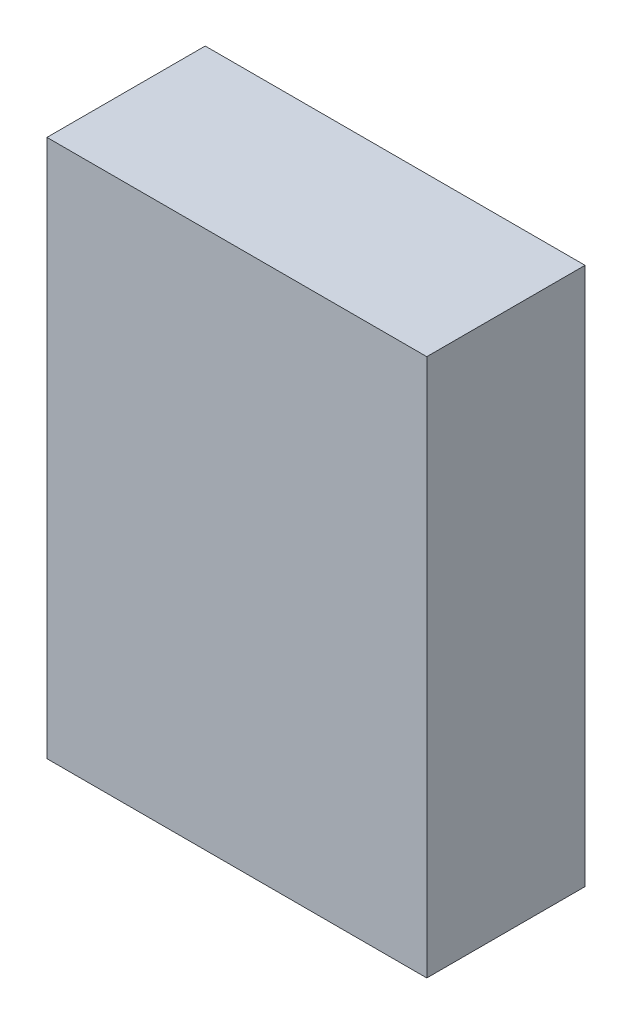
ISO-10303-21;
HEADER;
FILE_DESCRIPTION(('STEP AP214'),'2;1');
FILE_NAME('part.step','',(''),(''),'','','');
FILE_SCHEMA(('AUTOMOTIVE_DESIGN { 1 0 10303 214 1 1 1 1 }'));
ENDSEC;
DATA;
#1=APPLICATION_CONTEXT('core data for automotive mechanical design processes');
#2=APPLICATION_PROTOCOL_DEFINITION('international standard','automotive_design',2000,#1);
#3=PRODUCT_CONTEXT('',#1,'mechanical');
#4=PRODUCT('Part','Part','',(#3));
#5=PRODUCT_RELATED_PRODUCT_CATEGORY('part','',(#4));
#6=PRODUCT_DEFINITION_FORMATION('','',#4);
#7=PRODUCT_DEFINITION_CONTEXT('part definition',#1,'design');
#8=PRODUCT_DEFINITION('design','',#6,#7);
#9=PRODUCT_DEFINITION_SHAPE('','',#8);
#10=(LENGTH_UNIT() NAMED_UNIT(*) SI_UNIT(.MILLI.,.METRE.));
#11=(NAMED_UNIT(*) PLANE_ANGLE_UNIT() SI_UNIT($,.RADIAN.));
#12=(NAMED_UNIT(*) SI_UNIT($,.STERADIAN.) SOLID_ANGLE_UNIT());
#13=UNCERTAINTY_MEASURE_WITH_UNIT(LENGTH_MEASURE(1.E-05),#10,'distance_accuracy_value','');
#14=(GEOMETRIC_REPRESENTATION_CONTEXT(3) GLOBAL_UNCERTAINTY_ASSIGNED_CONTEXT((#13)) GLOBAL_UNIT_ASSIGNED_CONTEXT((#10,
#11,#12)) REPRESENTATION_CONTEXT('',''));
#15=CARTESIAN_POINT('',(0.,0.,0.));
#16=DIRECTION('',(0.,0.,1.));
#17=DIRECTION('',(1.,0.,0.));
#18=AXIS2_PLACEMENT_3D('',#15,#16,#17);
#19=CARTESIAN_POINT('',(-2.37,-2.92,0.));
#20=DIRECTION('',(1.,0.,0.));
#21=DIRECTION('',(0.,0.,1.));
#22=AXIS2_PLACEMENT_3D('',#19,#20,#21);
#23=PLANE('',#22);
#24=DIRECTION('',(0.,1.,0.));
#25=VECTOR('',#24,1.);
#26=CARTESIAN_POINT('',(-2.37,-2.92,0.1));
#27=LINE('',#26,#25);
#28=CARTESIAN_POINT('',(-2.37,-2.92,0.1));
#29=VERTEX_POINT('',#28);
#30=CARTESIAN_POINT('',(-2.37,-2.58,0.1));
#31=VERTEX_POINT('',#30);
#32=EDGE_CURVE('E11',#29,#31,#27,.T.);
#33=ORIENTED_EDGE('',*,*,#32,.T.);
#34=DIRECTION('',(0.,0.,1.));
#35=VECTOR('',#34,1.);
#36=CARTESIAN_POINT('',(-2.37,-2.58,0.));
#37=LINE('',#36,#35);
#38=CARTESIAN_POINT('',(-2.37,-2.58,0.));
#39=VERTEX_POINT('',#38);
#40=EDGE_CURVE('E24',#39,#31,#37,.T.);
#41=ORIENTED_EDGE('',*,*,#40,.F.);
#42=DIRECTION('',(0.,1.,0.));
#43=VECTOR('',#42,1.);
#44=CARTESIAN_POINT('',(-2.37,-2.92,0.));
#45=LINE('',#44,#43);
#46=CARTESIAN_POINT('',(-2.37,-2.92,0.));
#47=VERTEX_POINT('',#46);
#48=EDGE_CURVE('E86',#47,#39,#45,.T.);
#49=ORIENTED_EDGE('',*,*,#48,.F.);
#50=DIRECTION('',(0.,0.,1.));
#51=VECTOR('',#50,1.);
#52=CARTESIAN_POINT('',(-2.37,-2.92,0.));
#53=LINE('',#52,#51);
#54=EDGE_CURVE('E36',#47,#29,#53,.T.);
#55=ORIENTED_EDGE('',*,*,#54,.T.);
#56=EDGE_LOOP('',(#33,#41,#49,#55));
#57=FACE_BOUND('',#56,.T.);
#58=ADVANCED_FACE('F17',(#57),#23,.F.);
#59=CARTESIAN_POINT('',(-2.13,-2.92,0.));
#60=DIRECTION('',(1.,0.,0.));
#61=DIRECTION('',(0.,0.,1.));
#62=AXIS2_PLACEMENT_3D('',#59,#60,#61);
#63=PLANE('',#62);
#64=DIRECTION('',(0.,0.,1.));
#65=VECTOR('',#64,1.);
#66=CARTESIAN_POINT('',(-2.13,-2.92,0.));
#67=LINE('',#66,#65);
#68=CARTESIAN_POINT('',(-2.13,-2.92,0.));
#69=VERTEX_POINT('',#68);
#70=CARTESIAN_POINT('',(-2.13,-2.92,0.1));
#71=VERTEX_POINT('',#70);
#72=EDGE_CURVE('E83',#69,#71,#67,.T.);
#73=ORIENTED_EDGE('',*,*,#72,.F.);
#74=DIRECTION('',(0.,1.,0.));
#75=VECTOR('',#74,1.);
#76=CARTESIAN_POINT('',(-2.13,-2.92,0.));
#77=LINE('',#76,#75);
#78=CARTESIAN_POINT('',(-2.13,-2.58,0.));
#79=VERTEX_POINT('',#78);
#80=EDGE_CURVE('E63',#69,#79,#77,.T.);
#81=ORIENTED_EDGE('',*,*,#80,.T.);
#82=DIRECTION('',(0.,0.,1.));
#83=VECTOR('',#82,1.);
#84=CARTESIAN_POINT('',(-2.13,-2.58,0.));
#85=LINE('',#84,#83);
#86=CARTESIAN_POINT('',(-2.13,-2.58,0.1));
#87=VERTEX_POINT('',#86);
#88=EDGE_CURVE('E57',#79,#87,#85,.T.);
#89=ORIENTED_EDGE('',*,*,#88,.T.);
#90=DIRECTION('',(0.,1.,0.));
#91=VECTOR('',#90,1.);
#92=CARTESIAN_POINT('',(-2.13,-2.92,0.1));
#93=LINE('',#92,#91);
#94=EDGE_CURVE('E60',#71,#87,#93,.T.);
#95=ORIENTED_EDGE('',*,*,#94,.F.);
#96=EDGE_LOOP('',(#73,#81,#89,#95));
#97=FACE_BOUND('',#96,.T.);
#98=ADVANCED_FACE('F59',(#97),#63,.T.);
#99=CARTESIAN_POINT('',(-2.37,-2.92,0.));
#100=DIRECTION('',(0.,1.,0.));
#101=DIRECTION('',(0.,0.,1.));
#102=AXIS2_PLACEMENT_3D('',#99,#100,#101);
#103=PLANE('',#102);
#104=ORIENTED_EDGE('',*,*,#72,.T.);
#105=DIRECTION('',(1.,0.,0.));
#106=VECTOR('',#105,1.);
#107=CARTESIAN_POINT('',(-2.37,-2.92,0.1));
#108=LINE('',#107,#106);
#109=EDGE_CURVE('E71',#29,#71,#108,.T.);
#110=ORIENTED_EDGE('',*,*,#109,.F.);
#111=ORIENTED_EDGE('',*,*,#54,.F.);
#112=DIRECTION('',(1.,0.,0.));
#113=VECTOR('',#112,1.);
#114=CARTESIAN_POINT('',(-2.37,-2.92,0.));
#115=LINE('',#114,#113);
#116=EDGE_CURVE('E76',#47,#69,#115,.T.);
#117=ORIENTED_EDGE('',*,*,#116,.T.);
#118=EDGE_LOOP('',(#104,#110,#111,#117));
#119=FACE_BOUND('',#118,.T.);
#120=ADVANCED_FACE('F91',(#119),#103,.F.);
#121=CARTESIAN_POINT('',(-2.37,-2.58,0.));
#122=DIRECTION('',(0.,1.,0.));
#123=DIRECTION('',(0.,0.,1.));
#124=AXIS2_PLACEMENT_3D('',#121,#122,#123);
#125=PLANE('',#124);
#126=DIRECTION('',(1.,0.,0.));
#127=VECTOR('',#126,1.);
#128=CARTESIAN_POINT('',(-2.37,-2.58,0.));
#129=LINE('',#128,#127);
#130=EDGE_CURVE('E74',#39,#79,#129,.T.);
#131=ORIENTED_EDGE('',*,*,#130,.F.);
#132=ORIENTED_EDGE('',*,*,#40,.T.);
#133=DIRECTION('',(1.,0.,0.));
#134=VECTOR('',#133,1.);
#135=CARTESIAN_POINT('',(-2.37,-2.58,0.1));
#136=LINE('',#135,#134);
#137=EDGE_CURVE('E69',#31,#87,#136,.T.);
#138=ORIENTED_EDGE('',*,*,#137,.T.);
#139=ORIENTED_EDGE('',*,*,#88,.F.);
#140=EDGE_LOOP('',(#131,#132,#138,#139));
#141=FACE_BOUND('',#140,.T.);
#142=ADVANCED_FACE('F73',(#141),#125,.T.);
#143=CARTESIAN_POINT('',(-2.37,-2.92,0.));
#144=DIRECTION('',(0.,0.,1.));
#145=DIRECTION('',(1.,0.,0.));
#146=AXIS2_PLACEMENT_3D('',#143,#144,#145);
#147=PLANE('',#146);
#148=ORIENTED_EDGE('',*,*,#130,.T.);
#149=ORIENTED_EDGE('',*,*,#80,.F.);
#150=ORIENTED_EDGE('',*,*,#116,.F.);
#151=ORIENTED_EDGE('',*,*,#48,.T.);
#152=EDGE_LOOP('',(#148,#149,#150,#151));
#153=FACE_BOUND('',#152,.T.);
#154=ADVANCED_FACE('F89',(#153),#147,.F.);
#155=CARTESIAN_POINT('',(-2.37,-2.92,0.1));
#156=DIRECTION('',(0.,0.,1.));
#157=DIRECTION('',(1.,0.,0.));
#158=AXIS2_PLACEMENT_3D('',#155,#156,#157);
#159=PLANE('',#158);
#160=ORIENTED_EDGE('',*,*,#32,.F.);
#161=ORIENTED_EDGE('',*,*,#109,.T.);
#162=ORIENTED_EDGE('',*,*,#94,.T.);
#163=ORIENTED_EDGE('',*,*,#137,.F.);
#164=EDGE_LOOP('',(#160,#161,#162,#163));
#165=FACE_BOUND('',#164,.T.);
#166=ADVANCED_FACE('F68',(#165),#159,.T.);
#167=CLOSED_SHELL('',(#58,#98,#120,#142,#154,#166));
#168=MANIFOLD_SOLID_BREP('B1',#167);
#169=ADVANCED_BREP_SHAPE_REPRESENTATION('',(#18,#168),#14);
#170=SHAPE_DEFINITION_REPRESENTATION(#9,#169);
ENDSEC;
END-ISO-10303-21;
